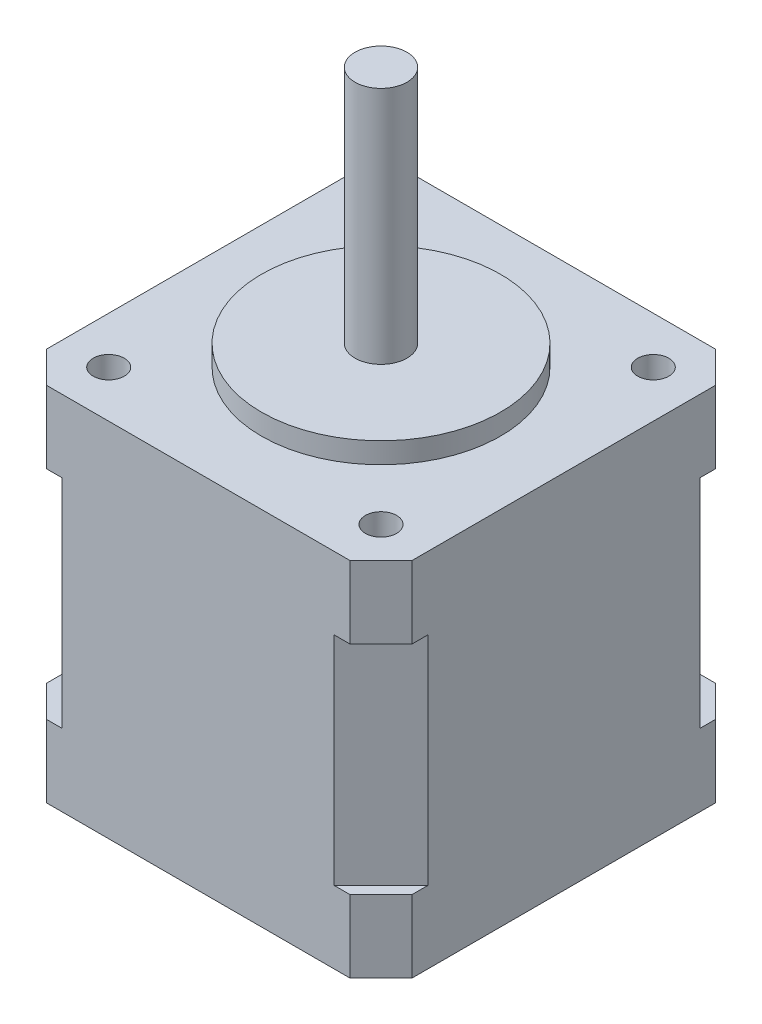
ISO-10303-21;
HEADER;
FILE_DESCRIPTION(('STEP AP214'),'2;1');
FILE_NAME('part.step','',(''),(''),'','','');
FILE_SCHEMA(('AUTOMOTIVE_DESIGN { 1 0 10303 214 1 1 1 1 }'));
ENDSEC;
DATA;
#1=APPLICATION_CONTEXT('core data for automotive mechanical design processes');
#2=APPLICATION_PROTOCOL_DEFINITION('international standard','automotive_design',2000,#1);
#3=PRODUCT_CONTEXT('',#1,'mechanical');
#4=PRODUCT('Part','Part','',(#3));
#5=PRODUCT_RELATED_PRODUCT_CATEGORY('part','',(#4));
#6=PRODUCT_DEFINITION_FORMATION('','',#4);
#7=PRODUCT_DEFINITION_CONTEXT('part definition',#1,'design');
#8=PRODUCT_DEFINITION('design','',#6,#7);
#9=PRODUCT_DEFINITION_SHAPE('','',#8);
#10=(LENGTH_UNIT() NAMED_UNIT(*) SI_UNIT(.MILLI.,.METRE.));
#11=(NAMED_UNIT(*) PLANE_ANGLE_UNIT() SI_UNIT($,.RADIAN.));
#12=(NAMED_UNIT(*) SI_UNIT($,.STERADIAN.) SOLID_ANGLE_UNIT());
#13=UNCERTAINTY_MEASURE_WITH_UNIT(LENGTH_MEASURE(1.E-05),#10,'distance_accuracy_value','');
#14=(GEOMETRIC_REPRESENTATION_CONTEXT(3) GLOBAL_UNCERTAINTY_ASSIGNED_CONTEXT((#13)) GLOBAL_UNIT_ASSIGNED_CONTEXT((#10,
#11,#12)) REPRESENTATION_CONTEXT('',''));
#15=CARTESIAN_POINT('',(0.,0.,0.));
#16=DIRECTION('',(0.,0.,1.));
#17=DIRECTION('',(1.,0.,0.));
#18=AXIS2_PLACEMENT_3D('',#15,#16,#17);
#19=CARTESIAN_POINT('',(0.,0.,0.));
#20=DIRECTION('',(0.,1.,0.));
#21=DIRECTION('',(0.,0.,1.));
#22=AXIS2_PLACEMENT_3D('',#19,#20,#21);
#23=PLANE('',#22);
#24=CARTESIAN_POINT('',(0.,0.,0.));
#25=DIRECTION('',(0.,-1.,0.));
#26=DIRECTION('',(0.,0.,-1.));
#27=AXIS2_PLACEMENT_3D('',#24,#25,#26);
#28=CIRCLE('',#27,2.5);
#29=CARTESIAN_POINT('',(0.,0.,-2.5));
#30=VERTEX_POINT('',#29);
#31=EDGE_CURVE('E293',#30,#30,#28,.T.);
#32=ORIENTED_EDGE('',*,*,#31,.F.);
#33=EDGE_LOOP('',(#32));
#34=FACE_BOUND('',#33,.T.);
#35=DIRECTION('',(-1.,0.,0.));
#36=VECTOR('',#35,1.);
#37=CARTESIAN_POINT('',(-17.6,0.,-17.6));
#38=LINE('',#37,#36);
#39=CARTESIAN_POINT('',(14.6,0.,-17.6));
#40=VERTEX_POINT('',#39);
#41=CARTESIAN_POINT('',(-14.6,0.,-17.6));
#42=VERTEX_POINT('',#41);
#43=EDGE_CURVE('E421',#40,#42,#38,.T.);
#44=ORIENTED_EDGE('',*,*,#43,.F.);
#45=DIRECTION('',(-0.707106781186548,0.,-0.707106781186547));
#46=VECTOR('',#45,1.);
#47=CARTESIAN_POINT('',(17.6,0.,-14.6));
#48=LINE('',#47,#46);
#49=CARTESIAN_POINT('',(17.6,0.,-14.6));
#50=VERTEX_POINT('',#49);
#51=EDGE_CURVE('E297',#50,#40,#48,.T.);
#52=ORIENTED_EDGE('',*,*,#51,.F.);
#53=DIRECTION('',(0.,0.,-1.));
#54=VECTOR('',#53,1.);
#55=CARTESIAN_POINT('',(17.6,0.,-17.6));
#56=LINE('',#55,#54);
#57=CARTESIAN_POINT('',(17.6,0.,14.6));
#58=VERTEX_POINT('',#57);
#59=EDGE_CURVE('E406',#58,#50,#56,.T.);
#60=ORIENTED_EDGE('',*,*,#59,.F.);
#61=DIRECTION('',(-0.707106781186548,0.,0.707106781186547));
#62=VECTOR('',#61,1.);
#63=CARTESIAN_POINT('',(17.6,0.,14.6));
#64=LINE('',#63,#62);
#65=CARTESIAN_POINT('',(14.6,0.,17.6));
#66=VERTEX_POINT('',#65);
#67=EDGE_CURVE('E317',#58,#66,#64,.T.);
#68=ORIENTED_EDGE('',*,*,#67,.T.);
#69=DIRECTION('',(1.,0.,0.));
#70=VECTOR('',#69,1.);
#71=CARTESIAN_POINT('',(-17.6,0.,17.6));
#72=LINE('',#71,#70);
#73=CARTESIAN_POINT('',(-14.6,0.,17.6));
#74=VERTEX_POINT('',#73);
#75=EDGE_CURVE('E42',#74,#66,#72,.T.);
#76=ORIENTED_EDGE('',*,*,#75,.F.);
#77=DIRECTION('',(0.707106781186548,0.,0.707106781186547));
#78=VECTOR('',#77,1.);
#79=CARTESIAN_POINT('',(-17.6,0.,14.6));
#80=LINE('',#79,#78);
#81=CARTESIAN_POINT('',(-17.6,0.,14.6));
#82=VERTEX_POINT('',#81);
#83=EDGE_CURVE('E326',#82,#74,#80,.T.);
#84=ORIENTED_EDGE('',*,*,#83,.F.);
#85=DIRECTION('',(0.,0.,1.));
#86=VECTOR('',#85,1.);
#87=CARTESIAN_POINT('',(-17.6,0.,-17.6));
#88=LINE('',#87,#86);
#89=CARTESIAN_POINT('',(-17.6,0.,-14.6));
#90=VERTEX_POINT('',#89);
#91=EDGE_CURVE('E63',#90,#82,#88,.T.);
#92=ORIENTED_EDGE('',*,*,#91,.F.);
#93=DIRECTION('',(0.707106781186548,0.,-0.707106781186547));
#94=VECTOR('',#93,1.);
#95=CARTESIAN_POINT('',(-17.6,0.,-14.6));
#96=LINE('',#95,#94);
#97=EDGE_CURVE('E307',#90,#42,#96,.T.);
#98=ORIENTED_EDGE('',*,*,#97,.T.);
#99=EDGE_LOOP('',(#44,#52,#60,#68,#76,#84,#92,#98));
#100=FACE_BOUND('',#99,.T.);
#101=ADVANCED_FACE('F38',(#34,#100),#23,.F.);
#102=CARTESIAN_POINT('',(-17.6,34.8,-17.6));
#103=DIRECTION('',(1.,0.,0.));
#104=DIRECTION('',(0.,0.,-1.));
#105=AXIS2_PLACEMENT_3D('',#102,#103,#104);
#106=PLANE('',#105);
#107=DIRECTION('',(0.,-1.,0.));
#108=VECTOR('',#107,1.);
#109=CARTESIAN_POINT('',(-17.6,6.96,14.6));
#110=LINE('',#109,#108);
#111=CARTESIAN_POINT('',(-17.6,6.96,14.6));
#112=VERTEX_POINT('',#111);
#113=EDGE_CURVE('E224',#112,#82,#110,.T.);
#114=ORIENTED_EDGE('',*,*,#113,.F.);
#115=DIRECTION('',(0.,0.,1.));
#116=VECTOR('',#115,1.);
#117=CARTESIAN_POINT('',(-17.6,6.96,17.6));
#118=LINE('',#117,#116);
#119=CARTESIAN_POINT('',(-17.6,6.96,13.1));
#120=VERTEX_POINT('',#119);
#121=EDGE_CURVE('E214',#120,#112,#118,.T.);
#122=ORIENTED_EDGE('',*,*,#121,.F.);
#123=DIRECTION('',(0.,1.,0.));
#124=VECTOR('',#123,1.);
#125=CARTESIAN_POINT('',(-17.6,0.596038969321061,13.1));
#126=LINE('',#125,#124);
#127=CARTESIAN_POINT('',(-17.6,27.84,13.1));
#128=VERTEX_POINT('',#127);
#129=EDGE_CURVE('E204',#120,#128,#126,.T.);
#130=ORIENTED_EDGE('',*,*,#129,.T.);
#131=DIRECTION('',(0.,0.,1.));
#132=VECTOR('',#131,1.);
#133=CARTESIAN_POINT('',(-17.6,27.84,17.6));
#134=LINE('',#133,#132);
#135=CARTESIAN_POINT('',(-17.6,27.84,14.6));
#136=VERTEX_POINT('',#135);
#137=EDGE_CURVE('E221',#128,#136,#134,.T.);
#138=ORIENTED_EDGE('',*,*,#137,.T.);
#139=DIRECTION('',(0.,1.,0.));
#140=VECTOR('',#139,1.);
#141=CARTESIAN_POINT('',(-17.6,27.84,14.6));
#142=LINE('',#141,#140);
#143=CARTESIAN_POINT('',(-17.6,34.8,14.6));
#144=VERTEX_POINT('',#143);
#145=EDGE_CURVE('E351',#136,#144,#142,.T.);
#146=ORIENTED_EDGE('',*,*,#145,.T.);
#147=DIRECTION('',(0.,0.,1.));
#148=VECTOR('',#147,1.);
#149=CARTESIAN_POINT('',(-17.6,34.8,-17.6));
#150=LINE('',#149,#148);
#151=CARTESIAN_POINT('',(-17.6,34.8,-14.6));
#152=VERTEX_POINT('',#151);
#153=EDGE_CURVE('E414',#152,#144,#150,.T.);
#154=ORIENTED_EDGE('',*,*,#153,.F.);
#155=DIRECTION('',(0.,1.,0.));
#156=VECTOR('',#155,1.);
#157=CARTESIAN_POINT('',(-17.6,27.84,-14.6));
#158=LINE('',#157,#156);
#159=CARTESIAN_POINT('',(-17.6,27.84,-14.6));
#160=VERTEX_POINT('',#159);
#161=EDGE_CURVE('E369',#160,#152,#158,.T.);
#162=ORIENTED_EDGE('',*,*,#161,.F.);
#163=DIRECTION('',(0.,0.,1.));
#164=VECTOR('',#163,1.);
#165=CARTESIAN_POINT('',(-17.6,27.84,-17.6));
#166=LINE('',#165,#164);
#167=CARTESIAN_POINT('',(-17.6,27.84,-13.1));
#168=VERTEX_POINT('',#167);
#169=EDGE_CURVE('E281',#160,#168,#166,.T.);
#170=ORIENTED_EDGE('',*,*,#169,.T.);
#171=DIRECTION('',(0.,1.,0.));
#172=VECTOR('',#171,1.);
#173=CARTESIAN_POINT('',(-17.6,0.596038969321075,-13.1));
#174=LINE('',#173,#172);
#175=CARTESIAN_POINT('',(-17.6,6.96,-13.1));
#176=VERTEX_POINT('',#175);
#177=EDGE_CURVE('E287',#176,#168,#174,.T.);
#178=ORIENTED_EDGE('',*,*,#177,.F.);
#179=DIRECTION('',(0.,0.,1.));
#180=VECTOR('',#179,1.);
#181=CARTESIAN_POINT('',(-17.6,6.96,-17.6));
#182=LINE('',#181,#180);
#183=CARTESIAN_POINT('',(-17.6,6.96,-14.6));
#184=VERTEX_POINT('',#183);
#185=EDGE_CURVE('E275',#184,#176,#182,.T.);
#186=ORIENTED_EDGE('',*,*,#185,.F.);
#187=DIRECTION('',(0.,-1.,0.));
#188=VECTOR('',#187,1.);
#189=CARTESIAN_POINT('',(-17.6,6.96,-14.6));
#190=LINE('',#189,#188);
#191=EDGE_CURVE('E315',#184,#90,#190,.T.);
#192=ORIENTED_EDGE('',*,*,#191,.T.);
#193=ORIENTED_EDGE('',*,*,#91,.T.);
#194=EDGE_LOOP('',(#114,#122,#130,#138,#146,#154,#162,#170,#178,#186,#192,#193));
#195=FACE_BOUND('',#194,.T.);
#196=ADVANCED_FACE('F223',(#195),#106,.F.);
#197=CARTESIAN_POINT('',(-17.6,34.8,-17.6));
#198=DIRECTION('',(0.,0.,1.));
#199=DIRECTION('',(1.,0.,0.));
#200=AXIS2_PLACEMENT_3D('',#197,#198,#199);
#201=PLANE('',#200);
#202=DIRECTION('',(0.,1.,0.));
#203=VECTOR('',#202,1.);
#204=CARTESIAN_POINT('',(13.1,0.596038969321075,-17.6));
#205=LINE('',#204,#203);
#206=CARTESIAN_POINT('',(13.1,6.96,-17.6));
#207=VERTEX_POINT('',#206);
#208=CARTESIAN_POINT('',(13.1,27.84,-17.6));
#209=VERTEX_POINT('',#208);
#210=EDGE_CURVE('E262',#207,#209,#205,.T.);
#211=ORIENTED_EDGE('',*,*,#210,.F.);
#212=DIRECTION('',(-1.,0.,0.));
#213=VECTOR('',#212,1.);
#214=CARTESIAN_POINT('',(17.6,6.96,-17.6));
#215=LINE('',#214,#213);
#216=CARTESIAN_POINT('',(14.6,6.96,-17.6));
#217=VERTEX_POINT('',#216);
#218=EDGE_CURVE('E255',#217,#207,#215,.T.);
#219=ORIENTED_EDGE('',*,*,#218,.F.);
#220=DIRECTION('',(0.,-1.,0.));
#221=VECTOR('',#220,1.);
#222=CARTESIAN_POINT('',(14.6,6.96,-17.6));
#223=LINE('',#222,#221);
#224=EDGE_CURVE('E304',#217,#40,#223,.T.);
#225=ORIENTED_EDGE('',*,*,#224,.T.);
#226=ORIENTED_EDGE('',*,*,#43,.T.);
#227=DIRECTION('',(0.,-1.,0.));
#228=VECTOR('',#227,1.);
#229=CARTESIAN_POINT('',(-14.6,6.96,-17.6));
#230=LINE('',#229,#228);
#231=CARTESIAN_POINT('',(-14.6,6.96,-17.6));
#232=VERTEX_POINT('',#231);
#233=EDGE_CURVE('E312',#232,#42,#230,.T.);
#234=ORIENTED_EDGE('',*,*,#233,.F.);
#235=DIRECTION('',(1.,0.,0.));
#236=VECTOR('',#235,1.);
#237=CARTESIAN_POINT('',(-17.6,6.96,-17.6));
#238=LINE('',#237,#236);
#239=CARTESIAN_POINT('',(-13.1,6.96,-17.6));
#240=VERTEX_POINT('',#239);
#241=EDGE_CURVE('E265',#232,#240,#238,.T.);
#242=ORIENTED_EDGE('',*,*,#241,.T.);
#243=DIRECTION('',(0.,1.,0.));
#244=VECTOR('',#243,1.);
#245=CARTESIAN_POINT('',(-13.1,0.596038969321075,-17.6));
#246=LINE('',#245,#244);
#247=CARTESIAN_POINT('',(-13.1,27.84,-17.6));
#248=VERTEX_POINT('',#247);
#249=EDGE_CURVE('E276',#240,#248,#246,.T.);
#250=ORIENTED_EDGE('',*,*,#249,.T.);
#251=DIRECTION('',(1.,0.,0.));
#252=VECTOR('',#251,1.);
#253=CARTESIAN_POINT('',(-17.6,27.84,-17.6));
#254=LINE('',#253,#252);
#255=CARTESIAN_POINT('',(-14.6,27.84,-17.6));
#256=VERTEX_POINT('',#255);
#257=EDGE_CURVE('E273',#256,#248,#254,.T.);
#258=ORIENTED_EDGE('',*,*,#257,.F.);
#259=DIRECTION('',(0.,1.,0.));
#260=VECTOR('',#259,1.);
#261=CARTESIAN_POINT('',(-14.6,27.84,-17.6));
#262=LINE('',#261,#260);
#263=CARTESIAN_POINT('',(-14.6,34.8,-17.6));
#264=VERTEX_POINT('',#263);
#265=EDGE_CURVE('E372',#256,#264,#262,.T.);
#266=ORIENTED_EDGE('',*,*,#265,.T.);
#267=DIRECTION('',(-1.,0.,0.));
#268=VECTOR('',#267,1.);
#269=CARTESIAN_POINT('',(-17.6,34.8,-17.6));
#270=LINE('',#269,#268);
#271=CARTESIAN_POINT('',(14.6,34.8,-17.6));
#272=VERTEX_POINT('',#271);
#273=EDGE_CURVE('E412',#272,#264,#270,.T.);
#274=ORIENTED_EDGE('',*,*,#273,.F.);
#275=DIRECTION('',(0.,1.,0.));
#276=VECTOR('',#275,1.);
#277=CARTESIAN_POINT('',(14.6,27.84,-17.6));
#278=LINE('',#277,#276);
#279=CARTESIAN_POINT('',(14.6,27.84,-17.6));
#280=VERTEX_POINT('',#279);
#281=EDGE_CURVE('E359',#280,#272,#278,.T.);
#282=ORIENTED_EDGE('',*,*,#281,.F.);
#283=DIRECTION('',(-1.,0.,0.));
#284=VECTOR('',#283,1.);
#285=CARTESIAN_POINT('',(17.6,27.84,-17.6));
#286=LINE('',#285,#284);
#287=EDGE_CURVE('E256',#280,#209,#286,.T.);
#288=ORIENTED_EDGE('',*,*,#287,.T.);
#289=EDGE_LOOP('',(#211,#219,#225,#226,#234,#242,#250,#258,#266,#274,#282,#288));
#290=FACE_BOUND('',#289,.T.);
#291=ADVANCED_FACE('F466',(#290),#201,.F.);
#292=CARTESIAN_POINT('',(-17.6,34.8,17.6));
#293=DIRECTION('',(0.,0.,-1.));
#294=DIRECTION('',(-1.,0.,0.));
#295=AXIS2_PLACEMENT_3D('',#292,#293,#294);
#296=PLANE('',#295);
#297=DIRECTION('',(0.,1.,0.));
#298=VECTOR('',#297,1.);
#299=CARTESIAN_POINT('',(-13.1,0.596038969321061,17.6));
#300=LINE('',#299,#298);
#301=CARTESIAN_POINT('',(-13.1,6.96,17.6));
#302=VERTEX_POINT('',#301);
#303=CARTESIAN_POINT('',(-13.1,27.84,17.6));
#304=VERTEX_POINT('',#303);
#305=EDGE_CURVE('E226',#302,#304,#300,.T.);
#306=ORIENTED_EDGE('',*,*,#305,.F.);
#307=DIRECTION('',(1.,0.,0.));
#308=VECTOR('',#307,1.);
#309=CARTESIAN_POINT('',(-17.6,6.96,17.6));
#310=LINE('',#309,#308);
#311=CARTESIAN_POINT('',(-14.6,6.96,17.6));
#312=VERTEX_POINT('',#311);
#313=EDGE_CURVE('E220',#312,#302,#310,.T.);
#314=ORIENTED_EDGE('',*,*,#313,.F.);
#315=DIRECTION('',(0.,-1.,0.));
#316=VECTOR('',#315,1.);
#317=CARTESIAN_POINT('',(-14.6,6.96,17.6));
#318=LINE('',#317,#316);
#319=EDGE_CURVE('E331',#312,#74,#318,.T.);
#320=ORIENTED_EDGE('',*,*,#319,.T.);
#321=ORIENTED_EDGE('',*,*,#75,.T.);
#322=DIRECTION('',(0.,-1.,0.));
#323=VECTOR('',#322,1.);
#324=CARTESIAN_POINT('',(14.6,6.96,17.6));
#325=LINE('',#324,#323);
#326=CARTESIAN_POINT('',(14.6,6.96,17.6));
#327=VERTEX_POINT('',#326);
#328=EDGE_CURVE('E55',#327,#66,#325,.T.);
#329=ORIENTED_EDGE('',*,*,#328,.F.);
#330=DIRECTION('',(1.,0.,0.));
#331=VECTOR('',#330,1.);
#332=CARTESIAN_POINT('',(17.6,6.96,17.6));
#333=LINE('',#332,#331);
#334=CARTESIAN_POINT('',(13.1,6.96,17.6));
#335=VERTEX_POINT('',#334);
#336=EDGE_CURVE('E242',#335,#327,#333,.T.);
#337=ORIENTED_EDGE('',*,*,#336,.F.);
#338=DIRECTION('',(0.,1.,0.));
#339=VECTOR('',#338,1.);
#340=CARTESIAN_POINT('',(13.1,0.596038969321068,17.6));
#341=LINE('',#340,#339);
#342=CARTESIAN_POINT('',(13.1,27.84,17.6));
#343=VERTEX_POINT('',#342);
#344=EDGE_CURVE('E245',#335,#343,#341,.T.);
#345=ORIENTED_EDGE('',*,*,#344,.T.);
#346=DIRECTION('',(1.,0.,0.));
#347=VECTOR('',#346,1.);
#348=CARTESIAN_POINT('',(17.6,27.84,17.6));
#349=LINE('',#348,#347);
#350=CARTESIAN_POINT('',(14.6,27.84,17.6));
#351=VERTEX_POINT('',#350);
#352=EDGE_CURVE('E230',#343,#351,#349,.T.);
#353=ORIENTED_EDGE('',*,*,#352,.T.);
#354=DIRECTION('',(0.,1.,0.));
#355=VECTOR('',#354,1.);
#356=CARTESIAN_POINT('',(14.6,27.84,17.6));
#357=LINE('',#356,#355);
#358=CARTESIAN_POINT('',(14.6,34.8,17.6));
#359=VERTEX_POINT('',#358);
#360=EDGE_CURVE('E340',#351,#359,#357,.T.);
#361=ORIENTED_EDGE('',*,*,#360,.T.);
#362=DIRECTION('',(1.,0.,0.));
#363=VECTOR('',#362,1.);
#364=CARTESIAN_POINT('',(-17.6,34.8,17.6));
#365=LINE('',#364,#363);
#366=CARTESIAN_POINT('',(-14.6,34.8,17.6));
#367=VERTEX_POINT('',#366);
#368=EDGE_CURVE('E409',#367,#359,#365,.T.);
#369=ORIENTED_EDGE('',*,*,#368,.F.);
#370=DIRECTION('',(0.,1.,0.));
#371=VECTOR('',#370,1.);
#372=CARTESIAN_POINT('',(-14.6,27.84,17.6));
#373=LINE('',#372,#371);
#374=CARTESIAN_POINT('',(-14.6,27.84,17.6));
#375=VERTEX_POINT('',#374);
#376=EDGE_CURVE('E348',#375,#367,#373,.T.);
#377=ORIENTED_EDGE('',*,*,#376,.F.);
#378=DIRECTION('',(1.,0.,0.));
#379=VECTOR('',#378,1.);
#380=CARTESIAN_POINT('',(-17.6,27.84,17.6));
#381=LINE('',#380,#379);
#382=EDGE_CURVE('E479',#375,#304,#381,.T.);
#383=ORIENTED_EDGE('',*,*,#382,.T.);
#384=EDGE_LOOP('',(#306,#314,#320,#321,#329,#337,#345,#353,#361,#369,#377,#383));
#385=FACE_BOUND('',#384,.T.);
#386=ADVANCED_FACE('F425',(#385),#296,.F.);
#387=CARTESIAN_POINT('',(17.6,34.8,-17.6));
#388=DIRECTION('',(-1.,0.,0.));
#389=DIRECTION('',(0.,0.,1.));
#390=AXIS2_PLACEMENT_3D('',#387,#388,#389);
#391=PLANE('',#390);
#392=DIRECTION('',(0.,1.,0.));
#393=VECTOR('',#392,1.);
#394=CARTESIAN_POINT('',(17.6,0.596038969321068,13.1));
#395=LINE('',#394,#393);
#396=CARTESIAN_POINT('',(17.6,6.96,13.1));
#397=VERTEX_POINT('',#396);
#398=CARTESIAN_POINT('',(17.6,27.84,13.1));
#399=VERTEX_POINT('',#398);
#400=EDGE_CURVE('E241',#397,#399,#395,.T.);
#401=ORIENTED_EDGE('',*,*,#400,.F.);
#402=DIRECTION('',(0.,0.,-1.));
#403=VECTOR('',#402,1.);
#404=CARTESIAN_POINT('',(17.6,6.96,17.6));
#405=LINE('',#404,#403);
#406=CARTESIAN_POINT('',(17.6,6.96,14.6));
#407=VERTEX_POINT('',#406);
#408=EDGE_CURVE('E234',#407,#397,#405,.T.);
#409=ORIENTED_EDGE('',*,*,#408,.F.);
#410=DIRECTION('',(0.,-1.,0.));
#411=VECTOR('',#410,1.);
#412=CARTESIAN_POINT('',(17.6,6.96,14.6));
#413=LINE('',#412,#411);
#414=EDGE_CURVE('E323',#407,#58,#413,.T.);
#415=ORIENTED_EDGE('',*,*,#414,.T.);
#416=ORIENTED_EDGE('',*,*,#59,.T.);
#417=DIRECTION('',(0.,-1.,0.));
#418=VECTOR('',#417,1.);
#419=CARTESIAN_POINT('',(17.6,6.96,-14.6));
#420=LINE('',#419,#418);
#421=CARTESIAN_POINT('',(17.6,6.96,-14.6));
#422=VERTEX_POINT('',#421);
#423=EDGE_CURVE('E302',#422,#50,#420,.T.);
#424=ORIENTED_EDGE('',*,*,#423,.F.);
#425=DIRECTION('',(0.,0.,-1.));
#426=VECTOR('',#425,1.);
#427=CARTESIAN_POINT('',(17.6,6.96,-17.6));
#428=LINE('',#427,#426);
#429=CARTESIAN_POINT('',(17.6,6.96,-13.1));
#430=VERTEX_POINT('',#429);
#431=EDGE_CURVE('E263',#430,#422,#428,.T.);
#432=ORIENTED_EDGE('',*,*,#431,.F.);
#433=DIRECTION('',(0.,1.,0.));
#434=VECTOR('',#433,1.);
#435=CARTESIAN_POINT('',(17.6,0.596038969321075,-13.1));
#436=LINE('',#435,#434);
#437=CARTESIAN_POINT('',(17.6,27.84,-13.1));
#438=VERTEX_POINT('',#437);
#439=EDGE_CURVE('E266',#430,#438,#436,.T.);
#440=ORIENTED_EDGE('',*,*,#439,.T.);
#441=DIRECTION('',(0.,0.,-1.));
#442=VECTOR('',#441,1.);
#443=CARTESIAN_POINT('',(17.6,27.84,-17.6));
#444=LINE('',#443,#442);
#445=CARTESIAN_POINT('',(17.6,27.84,-14.6));
#446=VERTEX_POINT('',#445);
#447=EDGE_CURVE('E244',#438,#446,#444,.T.);
#448=ORIENTED_EDGE('',*,*,#447,.T.);
#449=DIRECTION('',(0.,1.,0.));
#450=VECTOR('',#449,1.);
#451=CARTESIAN_POINT('',(17.6,27.84,-14.6));
#452=LINE('',#451,#450);
#453=CARTESIAN_POINT('',(17.6,34.8,-14.6));
#454=VERTEX_POINT('',#453);
#455=EDGE_CURVE('E362',#446,#454,#452,.T.);
#456=ORIENTED_EDGE('',*,*,#455,.T.);
#457=DIRECTION('',(0.,0.,-1.));
#458=VECTOR('',#457,1.);
#459=CARTESIAN_POINT('',(17.6,34.8,-17.6));
#460=LINE('',#459,#458);
#461=CARTESIAN_POINT('',(17.6,34.8,14.6));
#462=VERTEX_POINT('',#461);
#463=EDGE_CURVE('E410',#462,#454,#460,.T.);
#464=ORIENTED_EDGE('',*,*,#463,.F.);
#465=DIRECTION('',(0.,1.,0.));
#466=VECTOR('',#465,1.);
#467=CARTESIAN_POINT('',(17.6,27.84,14.6));
#468=LINE('',#467,#466);
#469=CARTESIAN_POINT('',(17.6,27.84,14.6));
#470=VERTEX_POINT('',#469);
#471=EDGE_CURVE('E338',#470,#462,#468,.T.);
#472=ORIENTED_EDGE('',*,*,#471,.F.);
#473=DIRECTION('',(0.,0.,-1.));
#474=VECTOR('',#473,1.);
#475=CARTESIAN_POINT('',(17.6,27.84,17.6));
#476=LINE('',#475,#474);
#477=EDGE_CURVE('E235',#470,#399,#476,.T.);
#478=ORIENTED_EDGE('',*,*,#477,.T.);
#479=EDGE_LOOP('',(#401,#409,#415,#416,#424,#432,#440,#448,#456,#464,#472,#478));
#480=FACE_BOUND('',#479,.T.);
#481=ADVANCED_FACE('F40',(#480),#391,.F.);
#482=CARTESIAN_POINT('',(0.,34.8,0.));
#483=DIRECTION('',(0.,1.,0.));
#484=DIRECTION('',(0.,0.,1.));
#485=AXIS2_PLACEMENT_3D('',#482,#483,#484);
#486=PLANE('',#485);
#487=DIRECTION('',(-0.707106781186548,0.,0.707106781186548));
#488=VECTOR('',#487,1.);
#489=CARTESIAN_POINT('',(17.6,34.8,14.6));
#490=LINE('',#489,#488);
#491=EDGE_CURVE('E334',#462,#359,#490,.T.);
#492=ORIENTED_EDGE('',*,*,#491,.F.);
#493=ORIENTED_EDGE('',*,*,#463,.T.);
#494=DIRECTION('',(-0.707106781186548,0.,-0.707106781186548));
#495=VECTOR('',#494,1.);
#496=CARTESIAN_POINT('',(17.6,34.8,-14.6));
#497=LINE('',#496,#495);
#498=EDGE_CURVE('E354',#454,#272,#497,.T.);
#499=ORIENTED_EDGE('',*,*,#498,.T.);
#500=ORIENTED_EDGE('',*,*,#273,.T.);
#501=DIRECTION('',(0.707106781186548,0.,-0.707106781186548));
#502=VECTOR('',#501,1.);
#503=CARTESIAN_POINT('',(-17.6,34.8,-14.6));
#504=LINE('',#503,#502);
#505=EDGE_CURVE('E365',#152,#264,#504,.T.);
#506=ORIENTED_EDGE('',*,*,#505,.F.);
#507=ORIENTED_EDGE('',*,*,#153,.T.);
#508=DIRECTION('',(0.707106781186548,0.,0.707106781186548));
#509=VECTOR('',#508,1.);
#510=CARTESIAN_POINT('',(-17.6,34.8,14.6));
#511=LINE('',#510,#509);
#512=EDGE_CURVE('E343',#144,#367,#511,.T.);
#513=ORIENTED_EDGE('',*,*,#512,.T.);
#514=ORIENTED_EDGE('',*,*,#368,.T.);
#515=EDGE_LOOP('',(#492,#493,#499,#500,#506,#507,#513,#514));
#516=FACE_BOUND('',#515,.T.);
#517=CARTESIAN_POINT('',(13.1,34.8,13.1));
#518=DIRECTION('',(0.,1.,0.));
#519=DIRECTION('',(0.,0.,-1.));
#520=AXIS2_PLACEMENT_3D('',#517,#518,#519);
#521=CIRCLE('',#520,1.5);
#522=CARTESIAN_POINT('',(13.1,34.8,11.6));
#523=VERTEX_POINT('',#522);
#524=EDGE_CURVE('E375',#523,#523,#521,.T.);
#525=ORIENTED_EDGE('',*,*,#524,.F.);
#526=EDGE_LOOP('',(#525));
#527=FACE_BOUND('',#526,.T.);
#528=CARTESIAN_POINT('',(-13.1,34.8,13.1));
#529=DIRECTION('',(0.,-1.,0.));
#530=DIRECTION('',(0.,0.,-1.));
#531=AXIS2_PLACEMENT_3D('',#528,#529,#530);
#532=CIRCLE('',#531,1.5);
#533=CARTESIAN_POINT('',(-13.1,34.8,11.6));
#534=VERTEX_POINT('',#533);
#535=EDGE_CURVE('E380',#534,#534,#532,.T.);
#536=ORIENTED_EDGE('',*,*,#535,.T.);
#537=EDGE_LOOP('',(#536));
#538=FACE_BOUND('',#537,.T.);
#539=CARTESIAN_POINT('',(13.1,34.8,-13.1));
#540=DIRECTION('',(0.,-1.,0.));
#541=DIRECTION('',(0.,0.,1.));
#542=AXIS2_PLACEMENT_3D('',#539,#540,#541);
#543=CIRCLE('',#542,1.5);
#544=CARTESIAN_POINT('',(13.1,34.8,-11.6));
#545=VERTEX_POINT('',#544);
#546=EDGE_CURVE('E386',#545,#545,#543,.T.);
#547=ORIENTED_EDGE('',*,*,#546,.T.);
#548=EDGE_LOOP('',(#547));
#549=FACE_BOUND('',#548,.T.);
#550=CARTESIAN_POINT('',(-13.1,34.8,-13.1));
#551=DIRECTION('',(0.,1.,0.));
#552=DIRECTION('',(0.,0.,1.));
#553=AXIS2_PLACEMENT_3D('',#550,#551,#552);
#554=CIRCLE('',#553,1.5);
#555=CARTESIAN_POINT('',(-13.1,34.8,-11.6));
#556=VERTEX_POINT('',#555);
#557=EDGE_CURVE('E392',#556,#556,#554,.T.);
#558=ORIENTED_EDGE('',*,*,#557,.F.);
#559=EDGE_LOOP('',(#558));
#560=FACE_BOUND('',#559,.T.);
#561=CARTESIAN_POINT('',(0.,34.8,0.));
#562=DIRECTION('',(0.,1.,0.));
#563=DIRECTION('',(0.,0.,1.));
#564=AXIS2_PLACEMENT_3D('',#561,#562,#563);
#565=CIRCLE('',#564,11.5);
#566=CARTESIAN_POINT('',(0.,34.8,11.5));
#567=VERTEX_POINT('',#566);
#568=EDGE_CURVE('E47',#567,#567,#565,.T.);
#569=ORIENTED_EDGE('',*,*,#568,.F.);
#570=EDGE_LOOP('',(#569));
#571=FACE_BOUND('',#570,.T.);
#572=ADVANCED_FACE('F455',(#516,#527,#538,#549,#560,#571),#486,.T.);
#573=CARTESIAN_POINT('',(0.,36.8,0.));
#574=DIRECTION('',(0.,-1.,0.));
#575=DIRECTION('',(0.,0.,-1.));
#576=AXIS2_PLACEMENT_3D('',#573,#574,#575);
#577=CYLINDRICAL_SURFACE('',#576,11.5);
#578=CARTESIAN_POINT('',(0.,36.8,0.));
#579=DIRECTION('',(0.,1.,0.));
#580=DIRECTION('',(0.,0.,1.));
#581=AXIS2_PLACEMENT_3D('',#578,#579,#580);
#582=CIRCLE('',#581,11.5);
#583=CARTESIAN_POINT('',(0.,36.8,11.5));
#584=VERTEX_POINT('',#583);
#585=EDGE_CURVE('E402',#584,#584,#582,.T.);
#586=ORIENTED_EDGE('',*,*,#585,.F.);
#587=EDGE_LOOP('',(#586));
#588=FACE_BOUND('',#587,.T.);
#589=ORIENTED_EDGE('',*,*,#568,.T.);
#590=EDGE_LOOP('',(#589));
#591=FACE_BOUND('',#590,.T.);
#592=ADVANCED_FACE('F530',(#588,#591),#577,.T.);
#593=CARTESIAN_POINT('',(0.,36.8,0.));
#594=DIRECTION('',(0.,1.,0.));
#595=DIRECTION('',(0.,0.,1.));
#596=AXIS2_PLACEMENT_3D('',#593,#594,#595);
#597=PLANE('',#596);
#598=CARTESIAN_POINT('',(0.,36.8,0.));
#599=DIRECTION('',(0.,1.,0.));
#600=DIRECTION('',(0.,0.,1.));
#601=AXIS2_PLACEMENT_3D('',#598,#599,#600);
#602=CIRCLE('',#601,2.5);
#603=CARTESIAN_POINT('',(0.,36.8,2.5));
#604=VERTEX_POINT('',#603);
#605=EDGE_CURVE('E11',#604,#604,#602,.T.);
#606=ORIENTED_EDGE('',*,*,#605,.F.);
#607=EDGE_LOOP('',(#606));
#608=FACE_BOUND('',#607,.T.);
#609=ORIENTED_EDGE('',*,*,#585,.T.);
#610=EDGE_LOOP('',(#609));
#611=FACE_BOUND('',#610,.T.);
#612=ADVANCED_FACE('F537',(#608,#611),#597,.T.);
#613=CARTESIAN_POINT('',(0.,59.8,0.));
#614=DIRECTION('',(0.,-1.,0.));
#615=DIRECTION('',(0.,0.,-1.));
#616=AXIS2_PLACEMENT_3D('',#613,#614,#615);
#617=CYLINDRICAL_SURFACE('',#616,2.5);
#618=CARTESIAN_POINT('',(0.,59.8,0.));
#619=DIRECTION('',(0.,1.,0.));
#620=DIRECTION('',(0.,0.,1.));
#621=AXIS2_PLACEMENT_3D('',#618,#619,#620);
#622=CIRCLE('',#621,2.5);
#623=CARTESIAN_POINT('',(0.,59.8,2.5));
#624=VERTEX_POINT('',#623);
#625=EDGE_CURVE('E398',#624,#624,#622,.T.);
#626=ORIENTED_EDGE('',*,*,#625,.F.);
#627=EDGE_LOOP('',(#626));
#628=FACE_BOUND('',#627,.T.);
#629=ORIENTED_EDGE('',*,*,#605,.T.);
#630=EDGE_LOOP('',(#629));
#631=FACE_BOUND('',#630,.T.);
#632=ADVANCED_FACE('F545',(#628,#631),#617,.T.);
#633=CARTESIAN_POINT('',(0.,59.8,0.));
#634=DIRECTION('',(0.,1.,0.));
#635=DIRECTION('',(0.,0.,1.));
#636=AXIS2_PLACEMENT_3D('',#633,#634,#635);
#637=PLANE('',#636);
#638=ORIENTED_EDGE('',*,*,#625,.T.);
#639=EDGE_LOOP('',(#638));
#640=FACE_BOUND('',#639,.T.);
#641=ADVANCED_FACE('F553',(#640),#637,.T.);
#642=CARTESIAN_POINT('',(-13.1,26.8,-13.1));
#643=DIRECTION('',(0.,1.,0.));
#644=DIRECTION('',(0.,0.,1.));
#645=AXIS2_PLACEMENT_3D('',#642,#643,#644);
#646=CYLINDRICAL_SURFACE('',#645,1.5);
#647=CARTESIAN_POINT('',(-13.1,26.8,-13.1));
#648=DIRECTION('',(0.,1.,0.));
#649=DIRECTION('',(0.,0.,1.));
#650=AXIS2_PLACEMENT_3D('',#647,#648,#649);
#651=CIRCLE('',#650,1.5);
#652=CARTESIAN_POINT('',(-13.1,26.8,-11.6));
#653=VERTEX_POINT('',#652);
#654=EDGE_CURVE('E395',#653,#653,#651,.T.);
#655=ORIENTED_EDGE('',*,*,#654,.F.);
#656=EDGE_LOOP('',(#655));
#657=FACE_BOUND('',#656,.T.);
#658=ORIENTED_EDGE('',*,*,#557,.T.);
#659=EDGE_LOOP('',(#658));
#660=FACE_BOUND('',#659,.T.);
#661=ADVANCED_FACE('F561',(#657,#660),#646,.F.);
#662=CARTESIAN_POINT('',(-13.1,26.8,-13.1));
#663=DIRECTION('',(0.,1.,0.));
#664=DIRECTION('',(0.,0.,1.));
#665=AXIS2_PLACEMENT_3D('',#662,#663,#664);
#666=PLANE('',#665);
#667=ORIENTED_EDGE('',*,*,#654,.T.);
#668=EDGE_LOOP('',(#667));
#669=FACE_BOUND('',#668,.T.);
#670=ADVANCED_FACE('F569',(#669),#666,.T.);
#671=CARTESIAN_POINT('',(13.1,26.8,-13.1));
#672=DIRECTION('',(0.,1.,0.));
#673=DIRECTION('',(0.,0.,1.));
#674=AXIS2_PLACEMENT_3D('',#671,#672,#673);
#675=CYLINDRICAL_SURFACE('',#674,1.5);
#676=CARTESIAN_POINT('',(13.1,26.8,-13.1));
#677=DIRECTION('',(0.,-1.,0.));
#678=DIRECTION('',(0.,0.,1.));
#679=AXIS2_PLACEMENT_3D('',#676,#677,#678);
#680=CIRCLE('',#679,1.5);
#681=CARTESIAN_POINT('',(13.1,26.8,-11.6));
#682=VERTEX_POINT('',#681);
#683=EDGE_CURVE('E389',#682,#682,#680,.T.);
#684=ORIENTED_EDGE('',*,*,#683,.T.);
#685=EDGE_LOOP('',(#684));
#686=FACE_BOUND('',#685,.T.);
#687=ORIENTED_EDGE('',*,*,#546,.F.);
#688=EDGE_LOOP('',(#687));
#689=FACE_BOUND('',#688,.T.);
#690=ADVANCED_FACE('F579',(#686,#689),#675,.F.);
#691=CARTESIAN_POINT('',(13.1,26.8,-13.1));
#692=DIRECTION('',(0.,1.,0.));
#693=DIRECTION('',(0.,0.,1.));
#694=AXIS2_PLACEMENT_3D('',#691,#692,#693);
#695=PLANE('',#694);
#696=ORIENTED_EDGE('',*,*,#683,.F.);
#697=EDGE_LOOP('',(#696));
#698=FACE_BOUND('',#697,.T.);
#699=ADVANCED_FACE('F587',(#698),#695,.T.);
#700=CARTESIAN_POINT('',(-13.1,26.8,13.1));
#701=DIRECTION('',(0.,1.,0.));
#702=DIRECTION('',(0.,0.,1.));
#703=AXIS2_PLACEMENT_3D('',#700,#701,#702);
#704=CYLINDRICAL_SURFACE('',#703,1.5);
#705=CARTESIAN_POINT('',(-13.1,26.8,13.1));
#706=DIRECTION('',(0.,-1.,0.));
#707=DIRECTION('',(0.,0.,-1.));
#708=AXIS2_PLACEMENT_3D('',#705,#706,#707);
#709=CIRCLE('',#708,1.5);
#710=CARTESIAN_POINT('',(-13.1,26.8,11.6));
#711=VERTEX_POINT('',#710);
#712=EDGE_CURVE('E383',#711,#711,#709,.T.);
#713=ORIENTED_EDGE('',*,*,#712,.T.);
#714=EDGE_LOOP('',(#713));
#715=FACE_BOUND('',#714,.T.);
#716=ORIENTED_EDGE('',*,*,#535,.F.);
#717=EDGE_LOOP('',(#716));
#718=FACE_BOUND('',#717,.T.);
#719=ADVANCED_FACE('F594',(#715,#718),#704,.F.);
#720=CARTESIAN_POINT('',(-13.1,26.8,13.1));
#721=DIRECTION('',(0.,1.,0.));
#722=DIRECTION('',(0.,0.,-1.));
#723=AXIS2_PLACEMENT_3D('',#720,#721,#722);
#724=PLANE('',#723);
#725=ORIENTED_EDGE('',*,*,#712,.F.);
#726=EDGE_LOOP('',(#725));
#727=FACE_BOUND('',#726,.T.);
#728=ADVANCED_FACE('F602',(#727),#724,.T.);
#729=CARTESIAN_POINT('',(13.1,26.8,13.1));
#730=DIRECTION('',(0.,1.,0.));
#731=DIRECTION('',(0.,0.,1.));
#732=AXIS2_PLACEMENT_3D('',#729,#730,#731);
#733=CYLINDRICAL_SURFACE('',#732,1.5);
#734=CARTESIAN_POINT('',(13.1,26.8,13.1));
#735=DIRECTION('',(0.,1.,0.));
#736=DIRECTION('',(0.,0.,-1.));
#737=AXIS2_PLACEMENT_3D('',#734,#735,#736);
#738=CIRCLE('',#737,1.5);
#739=CARTESIAN_POINT('',(13.1,26.8,11.6));
#740=VERTEX_POINT('',#739);
#741=EDGE_CURVE('E377',#740,#740,#738,.T.);
#742=ORIENTED_EDGE('',*,*,#741,.F.);
#743=EDGE_LOOP('',(#742));
#744=FACE_BOUND('',#743,.T.);
#745=ORIENTED_EDGE('',*,*,#524,.T.);
#746=EDGE_LOOP('',(#745));
#747=FACE_BOUND('',#746,.T.);
#748=ADVANCED_FACE('F610',(#744,#747),#733,.F.);
#749=CARTESIAN_POINT('',(13.1,26.8,13.1));
#750=DIRECTION('',(0.,1.,0.));
#751=DIRECTION('',(0.,0.,-1.));
#752=AXIS2_PLACEMENT_3D('',#749,#750,#751);
#753=PLANE('',#752);
#754=ORIENTED_EDGE('',*,*,#741,.T.);
#755=EDGE_LOOP('',(#754));
#756=FACE_BOUND('',#755,.T.);
#757=ADVANCED_FACE('F618',(#756),#753,.T.);
#758=CARTESIAN_POINT('',(-17.6,27.84,-14.6));
#759=DIRECTION('',(0.707106781186547,0.,0.707106781186547));
#760=DIRECTION('',(0.707106781186548,0.,-0.707106781186548));
#761=AXIS2_PLACEMENT_3D('',#758,#759,#760);
#762=PLANE('',#761);
#763=ORIENTED_EDGE('',*,*,#505,.T.);
#764=ORIENTED_EDGE('',*,*,#265,.F.);
#765=DIRECTION('',(0.707106781186548,0.,-0.707106781186548));
#766=VECTOR('',#765,1.);
#767=CARTESIAN_POINT('',(-17.6,27.84,-14.6));
#768=LINE('',#767,#766);
#769=EDGE_CURVE('E367',#160,#256,#768,.T.);
#770=ORIENTED_EDGE('',*,*,#769,.F.);
#771=ORIENTED_EDGE('',*,*,#161,.T.);
#772=EDGE_LOOP('',(#763,#764,#770,#771));
#773=FACE_BOUND('',#772,.T.);
#774=ADVANCED_FACE('F471',(#773),#762,.F.);
#775=CARTESIAN_POINT('',(17.6,27.84,-14.6));
#776=DIRECTION('',(0.707106781186547,0.,-0.707106781186547));
#777=DIRECTION('',(-0.707106781186548,0.,-0.707106781186548));
#778=AXIS2_PLACEMENT_3D('',#775,#776,#777);
#779=PLANE('',#778);
#780=ORIENTED_EDGE('',*,*,#498,.F.);
#781=ORIENTED_EDGE('',*,*,#455,.F.);
#782=DIRECTION('',(-0.707106781186548,0.,-0.707106781186548));
#783=VECTOR('',#782,1.);
#784=CARTESIAN_POINT('',(17.6,27.84,-14.6));
#785=LINE('',#784,#783);
#786=EDGE_CURVE('E356',#446,#280,#785,.T.);
#787=ORIENTED_EDGE('',*,*,#786,.T.);
#788=ORIENTED_EDGE('',*,*,#281,.T.);
#789=EDGE_LOOP('',(#780,#781,#787,#788));
#790=FACE_BOUND('',#789,.T.);
#791=ADVANCED_FACE('F460',(#790),#779,.T.);
#792=CARTESIAN_POINT('',(-17.6,27.84,14.6));
#793=DIRECTION('',(-0.707106781186547,0.,0.707106781186547));
#794=DIRECTION('',(0.707106781186548,0.,0.707106781186548));
#795=AXIS2_PLACEMENT_3D('',#792,#793,#794);
#796=PLANE('',#795);
#797=ORIENTED_EDGE('',*,*,#512,.F.);
#798=ORIENTED_EDGE('',*,*,#145,.F.);
#799=DIRECTION('',(0.707106781186548,0.,0.707106781186548));
#800=VECTOR('',#799,1.);
#801=CARTESIAN_POINT('',(-17.6,27.84,14.6));
#802=LINE('',#801,#800);
#803=EDGE_CURVE('E345',#136,#375,#802,.T.);
#804=ORIENTED_EDGE('',*,*,#803,.T.);
#805=ORIENTED_EDGE('',*,*,#376,.T.);
#806=EDGE_LOOP('',(#797,#798,#804,#805));
#807=FACE_BOUND('',#806,.T.);
#808=ADVANCED_FACE('F476',(#807),#796,.T.);
#809=CARTESIAN_POINT('',(17.6,27.84,14.6));
#810=DIRECTION('',(-0.707106781186547,0.,-0.707106781186547));
#811=DIRECTION('',(-0.707106781186548,0.,0.707106781186548));
#812=AXIS2_PLACEMENT_3D('',#809,#810,#811);
#813=PLANE('',#812);
#814=ORIENTED_EDGE('',*,*,#491,.T.);
#815=ORIENTED_EDGE('',*,*,#360,.F.);
#816=DIRECTION('',(-0.707106781186548,0.,0.707106781186548));
#817=VECTOR('',#816,1.);
#818=CARTESIAN_POINT('',(17.6,27.84,14.6));
#819=LINE('',#818,#817);
#820=EDGE_CURVE('E336',#470,#351,#819,.T.);
#821=ORIENTED_EDGE('',*,*,#820,.F.);
#822=ORIENTED_EDGE('',*,*,#471,.T.);
#823=EDGE_LOOP('',(#814,#815,#821,#822));
#824=FACE_BOUND('',#823,.T.);
#825=ADVANCED_FACE('F450',(#824),#813,.F.);
#826=CARTESIAN_POINT('',(-17.6,6.96,14.6));
#827=DIRECTION('',(0.707106781186547,0.,-0.707106781186548));
#828=DIRECTION('',(-0.707106781186548,0.,-0.707106781186547));
#829=AXIS2_PLACEMENT_3D('',#826,#827,#828);
#830=PLANE('',#829);
#831=ORIENTED_EDGE('',*,*,#83,.T.);
#832=ORIENTED_EDGE('',*,*,#319,.F.);
#833=DIRECTION('',(0.707106781186548,0.,0.707106781186547));
#834=VECTOR('',#833,1.);
#835=CARTESIAN_POINT('',(-17.6,6.96,14.6));
#836=LINE('',#835,#834);
#837=EDGE_CURVE('E328',#112,#312,#836,.T.);
#838=ORIENTED_EDGE('',*,*,#837,.F.);
#839=ORIENTED_EDGE('',*,*,#113,.T.);
#840=EDGE_LOOP('',(#831,#832,#838,#839));
#841=FACE_BOUND('',#840,.T.);
#842=ADVANCED_FACE('F649',(#841),#830,.F.);
#843=CARTESIAN_POINT('',(17.6,6.96,14.6));
#844=DIRECTION('',(0.707106781186547,0.,0.707106781186548));
#845=DIRECTION('',(0.707106781186548,0.,-0.707106781186547));
#846=AXIS2_PLACEMENT_3D('',#843,#844,#845);
#847=PLANE('',#846);
#848=ORIENTED_EDGE('',*,*,#67,.F.);
#849=ORIENTED_EDGE('',*,*,#414,.F.);
#850=DIRECTION('',(-0.707106781186548,0.,0.707106781186547));
#851=VECTOR('',#850,1.);
#852=CARTESIAN_POINT('',(17.6,6.96,14.6));
#853=LINE('',#852,#851);
#854=EDGE_CURVE('E320',#407,#327,#853,.T.);
#855=ORIENTED_EDGE('',*,*,#854,.T.);
#856=ORIENTED_EDGE('',*,*,#328,.T.);
#857=EDGE_LOOP('',(#848,#849,#855,#856));
#858=FACE_BOUND('',#857,.T.);
#859=ADVANCED_FACE('F434',(#858),#847,.T.);
#860=CARTESIAN_POINT('',(-17.6,6.96,-14.6));
#861=DIRECTION('',(-0.707106781186547,0.,-0.707106781186548));
#862=DIRECTION('',(-0.707106781186548,0.,0.707106781186547));
#863=AXIS2_PLACEMENT_3D('',#860,#861,#862);
#864=PLANE('',#863);
#865=ORIENTED_EDGE('',*,*,#97,.F.);
#866=ORIENTED_EDGE('',*,*,#191,.F.);
#867=DIRECTION('',(0.707106781186548,0.,-0.707106781186547));
#868=VECTOR('',#867,1.);
#869=CARTESIAN_POINT('',(-17.6,6.96,-14.6));
#870=LINE('',#869,#868);
#871=EDGE_CURVE('E309',#184,#232,#870,.T.);
#872=ORIENTED_EDGE('',*,*,#871,.T.);
#873=ORIENTED_EDGE('',*,*,#233,.T.);
#874=EDGE_LOOP('',(#865,#866,#872,#873));
#875=FACE_BOUND('',#874,.T.);
#876=ADVANCED_FACE('F662',(#875),#864,.T.);
#877=CARTESIAN_POINT('',(17.6,6.96,-14.6));
#878=DIRECTION('',(-0.707106781186547,0.,0.707106781186548));
#879=DIRECTION('',(0.707106781186548,0.,0.707106781186547));
#880=AXIS2_PLACEMENT_3D('',#877,#878,#879);
#881=PLANE('',#880);
#882=ORIENTED_EDGE('',*,*,#51,.T.);
#883=ORIENTED_EDGE('',*,*,#224,.F.);
#884=DIRECTION('',(-0.707106781186548,0.,-0.707106781186547));
#885=VECTOR('',#884,1.);
#886=CARTESIAN_POINT('',(17.6,6.96,-14.6));
#887=LINE('',#886,#885);
#888=EDGE_CURVE('E300',#422,#217,#887,.T.);
#889=ORIENTED_EDGE('',*,*,#888,.F.);
#890=ORIENTED_EDGE('',*,*,#423,.T.);
#891=EDGE_LOOP('',(#882,#883,#889,#890));
#892=FACE_BOUND('',#891,.T.);
#893=ADVANCED_FACE('F668',(#892),#881,.F.);
#894=CARTESIAN_POINT('',(0.,5.,0.));
#895=DIRECTION('',(0.,-1.,0.));
#896=DIRECTION('',(0.,0.,-1.));
#897=AXIS2_PLACEMENT_3D('',#894,#895,#896);
#898=CYLINDRICAL_SURFACE('',#897,2.5);
#899=CARTESIAN_POINT('',(0.,5.,0.));
#900=DIRECTION('',(0.,-1.,0.));
#901=DIRECTION('',(0.,0.,-1.));
#902=AXIS2_PLACEMENT_3D('',#899,#900,#901);
#903=CIRCLE('',#902,2.5);
#904=CARTESIAN_POINT('',(0.,5.,-2.5));
#905=VERTEX_POINT('',#904);
#906=EDGE_CURVE('E294',#905,#905,#903,.T.);
#907=ORIENTED_EDGE('',*,*,#906,.F.);
#908=EDGE_LOOP('',(#907));
#909=FACE_BOUND('',#908,.T.);
#910=ORIENTED_EDGE('',*,*,#31,.T.);
#911=EDGE_LOOP('',(#910));
#912=FACE_BOUND('',#911,.T.);
#913=ADVANCED_FACE('F675',(#909,#912),#898,.F.);
#914=CARTESIAN_POINT('',(0.,5.,0.));
#915=DIRECTION('',(0.,-1.,0.));
#916=DIRECTION('',(0.,0.,-1.));
#917=AXIS2_PLACEMENT_3D('',#914,#915,#916);
#918=PLANE('',#917);
#919=ORIENTED_EDGE('',*,*,#906,.T.);
#920=EDGE_LOOP('',(#919));
#921=FACE_BOUND('',#920,.T.);
#922=ADVANCED_FACE('F682',(#921),#918,.T.);
#923=CARTESIAN_POINT('',(0.,27.84,0.));
#924=DIRECTION('',(0.,1.,0.));
#925=DIRECTION('',(0.,0.,1.));
#926=AXIS2_PLACEMENT_3D('',#923,#924,#925);
#927=PLANE('',#926);
#928=ORIENTED_EDGE('',*,*,#257,.T.);
#929=DIRECTION('',(0.707106781186547,0.,-0.707106781186547));
#930=VECTOR('',#929,1.);
#931=CARTESIAN_POINT('',(-17.6,27.84,-13.1));
#932=LINE('',#931,#930);
#933=EDGE_CURVE('E277',#168,#248,#932,.T.);
#934=ORIENTED_EDGE('',*,*,#933,.F.);
#935=ORIENTED_EDGE('',*,*,#169,.F.);
#936=ORIENTED_EDGE('',*,*,#769,.T.);
#937=EDGE_LOOP('',(#928,#934,#935,#936));
#938=FACE_BOUND('',#937,.T.);
#939=ADVANCED_FACE('F690',(#938),#927,.F.);
#940=CARTESIAN_POINT('',(0.,6.96,0.));
#941=DIRECTION('',(0.,-1.,0.));
#942=DIRECTION('',(0.,0.,1.));
#943=AXIS2_PLACEMENT_3D('',#940,#941,#942);
#944=PLANE('',#943);
#945=ORIENTED_EDGE('',*,*,#871,.F.);
#946=ORIENTED_EDGE('',*,*,#185,.T.);
#947=DIRECTION('',(0.707106781186548,0.,-0.707106781186548));
#948=VECTOR('',#947,1.);
#949=CARTESIAN_POINT('',(-17.6,6.96,-13.1));
#950=LINE('',#949,#948);
#951=EDGE_CURVE('E280',#176,#240,#950,.T.);
#952=ORIENTED_EDGE('',*,*,#951,.T.);
#953=ORIENTED_EDGE('',*,*,#241,.F.);
#954=EDGE_LOOP('',(#945,#946,#952,#953));
#955=FACE_BOUND('',#954,.T.);
#956=ADVANCED_FACE('F698',(#955),#944,.F.);
#957=CARTESIAN_POINT('',(-17.6,0.596038969321075,-13.1));
#958=DIRECTION('',(0.707106781186547,0.,0.707106781186547));
#959=DIRECTION('',(0.707106781186548,0.,-0.707106781186548));
#960=AXIS2_PLACEMENT_3D('',#957,#958,#959);
#961=PLANE('',#960);
#962=ORIENTED_EDGE('',*,*,#177,.T.);
#963=ORIENTED_EDGE('',*,*,#933,.T.);
#964=ORIENTED_EDGE('',*,*,#249,.F.);
#965=ORIENTED_EDGE('',*,*,#951,.F.);
#966=EDGE_LOOP('',(#962,#963,#964,#965));
#967=FACE_BOUND('',#966,.T.);
#968=ADVANCED_FACE('F706',(#967),#961,.F.);
#969=CARTESIAN_POINT('',(0.,6.96,0.));
#970=DIRECTION('',(0.,-1.,0.));
#971=DIRECTION('',(0.,0.,1.));
#972=AXIS2_PLACEMENT_3D('',#969,#970,#971);
#973=PLANE('',#972);
#974=ORIENTED_EDGE('',*,*,#218,.T.);
#975=DIRECTION('',(0.707106781186548,0.,0.707106781186547));
#976=VECTOR('',#975,1.);
#977=CARTESIAN_POINT('',(17.6,6.96,-13.1));
#978=LINE('',#977,#976);
#979=EDGE_CURVE('E267',#207,#430,#978,.T.);
#980=ORIENTED_EDGE('',*,*,#979,.T.);
#981=ORIENTED_EDGE('',*,*,#431,.T.);
#982=ORIENTED_EDGE('',*,*,#888,.T.);
#983=EDGE_LOOP('',(#974,#980,#981,#982));
#984=FACE_BOUND('',#983,.T.);
#985=ADVANCED_FACE('F715',(#984),#973,.F.);
#986=CARTESIAN_POINT('',(0.,27.84,0.));
#987=DIRECTION('',(0.,-1.,0.));
#988=DIRECTION('',(0.,0.,-1.));
#989=AXIS2_PLACEMENT_3D('',#986,#987,#988);
#990=PLANE('',#989);
#991=ORIENTED_EDGE('',*,*,#447,.F.);
#992=DIRECTION('',(0.707106781186548,0.,0.707106781186547));
#993=VECTOR('',#992,1.);
#994=CARTESIAN_POINT('',(17.6,27.84,-13.1));
#995=LINE('',#994,#993);
#996=EDGE_CURVE('E252',#209,#438,#995,.T.);
#997=ORIENTED_EDGE('',*,*,#996,.F.);
#998=ORIENTED_EDGE('',*,*,#287,.F.);
#999=ORIENTED_EDGE('',*,*,#786,.F.);
#1000=EDGE_LOOP('',(#991,#997,#998,#999));
#1001=FACE_BOUND('',#1000,.T.);
#1002=ADVANCED_FACE('F723',(#1001),#990,.T.);
#1003=CARTESIAN_POINT('',(17.6,0.596038969321075,-13.1));
#1004=DIRECTION('',(-0.707106781186547,0.,0.707106781186548));
#1005=DIRECTION('',(0.707106781186548,0.,0.707106781186547));
#1006=AXIS2_PLACEMENT_3D('',#1003,#1004,#1005);
#1007=PLANE('',#1006);
#1008=ORIENTED_EDGE('',*,*,#210,.T.);
#1009=ORIENTED_EDGE('',*,*,#996,.T.);
#1010=ORIENTED_EDGE('',*,*,#439,.F.);
#1011=ORIENTED_EDGE('',*,*,#979,.F.);
#1012=EDGE_LOOP('',(#1008,#1009,#1010,#1011));
#1013=FACE_BOUND('',#1012,.T.);
#1014=ADVANCED_FACE('F731',(#1013),#1007,.F.);
#1015=CARTESIAN_POINT('',(0.,27.84,0.));
#1016=DIRECTION('',(0.,-1.,0.));
#1017=DIRECTION('',(0.,0.,-1.));
#1018=AXIS2_PLACEMENT_3D('',#1015,#1016,#1017);
#1019=PLANE('',#1018);
#1020=ORIENTED_EDGE('',*,*,#820,.T.);
#1021=ORIENTED_EDGE('',*,*,#352,.F.);
#1022=DIRECTION('',(-0.707106781186548,0.,0.707106781186547));
#1023=VECTOR('',#1022,1.);
#1024=CARTESIAN_POINT('',(13.1,27.84,17.6));
#1025=LINE('',#1024,#1023);
#1026=EDGE_CURVE('E231',#399,#343,#1025,.T.);
#1027=ORIENTED_EDGE('',*,*,#1026,.F.);
#1028=ORIENTED_EDGE('',*,*,#477,.F.);
#1029=EDGE_LOOP('',(#1020,#1021,#1027,#1028));
#1030=FACE_BOUND('',#1029,.T.);
#1031=ADVANCED_FACE('F739',(#1030),#1019,.T.);
#1032=CARTESIAN_POINT('',(0.,6.96,0.));
#1033=DIRECTION('',(0.,-1.,0.));
#1034=DIRECTION('',(0.,0.,-1.));
#1035=AXIS2_PLACEMENT_3D('',#1032,#1033,#1034);
#1036=PLANE('',#1035);
#1037=ORIENTED_EDGE('',*,*,#854,.F.);
#1038=ORIENTED_EDGE('',*,*,#408,.T.);
#1039=DIRECTION('',(-0.707106781186548,0.,0.707106781186547));
#1040=VECTOR('',#1039,1.);
#1041=CARTESIAN_POINT('',(13.1,6.96,17.6));
#1042=LINE('',#1041,#1040);
#1043=EDGE_CURVE('E246',#397,#335,#1042,.T.);
#1044=ORIENTED_EDGE('',*,*,#1043,.T.);
#1045=ORIENTED_EDGE('',*,*,#336,.T.);
#1046=EDGE_LOOP('',(#1037,#1038,#1044,#1045));
#1047=FACE_BOUND('',#1046,.T.);
#1048=ADVANCED_FACE('F441',(#1047),#1036,.F.);
#1049=CARTESIAN_POINT('',(13.1,0.596038969321068,17.6));
#1050=DIRECTION('',(-0.707106781186547,0.,-0.707106781186548));
#1051=DIRECTION('',(-0.707106781186548,0.,0.707106781186547));
#1052=AXIS2_PLACEMENT_3D('',#1049,#1050,#1051);
#1053=PLANE('',#1052);
#1054=ORIENTED_EDGE('',*,*,#400,.T.);
#1055=ORIENTED_EDGE('',*,*,#1026,.T.);
#1056=ORIENTED_EDGE('',*,*,#344,.F.);
#1057=ORIENTED_EDGE('',*,*,#1043,.F.);
#1058=EDGE_LOOP('',(#1054,#1055,#1056,#1057));
#1059=FACE_BOUND('',#1058,.T.);
#1060=ADVANCED_FACE('F443',(#1059),#1053,.F.);
#1061=CARTESIAN_POINT('',(0.,6.96,0.));
#1062=DIRECTION('',(0.,-1.,0.));
#1063=DIRECTION('',(0.,0.,-1.));
#1064=AXIS2_PLACEMENT_3D('',#1061,#1062,#1063);
#1065=PLANE('',#1064);
#1066=ORIENTED_EDGE('',*,*,#313,.T.);
#1067=DIRECTION('',(-0.707106781186548,0.,-0.707106781186547));
#1068=VECTOR('',#1067,1.);
#1069=CARTESIAN_POINT('',(-13.1,6.96,17.6));
#1070=LINE('',#1069,#1068);
#1071=EDGE_CURVE('E207',#302,#120,#1070,.T.);
#1072=ORIENTED_EDGE('',*,*,#1071,.T.);
#1073=ORIENTED_EDGE('',*,*,#121,.T.);
#1074=ORIENTED_EDGE('',*,*,#837,.T.);
#1075=EDGE_LOOP('',(#1066,#1072,#1073,#1074));
#1076=FACE_BOUND('',#1075,.T.);
#1077=ADVANCED_FACE('F217',(#1076),#1065,.F.);
#1078=CARTESIAN_POINT('',(0.,27.84,0.));
#1079=DIRECTION('',(0.,1.,0.));
#1080=DIRECTION('',(0.,0.,1.));
#1081=AXIS2_PLACEMENT_3D('',#1078,#1079,#1080);
#1082=PLANE('',#1081);
#1083=ORIENTED_EDGE('',*,*,#803,.F.);
#1084=ORIENTED_EDGE('',*,*,#137,.F.);
#1085=DIRECTION('',(-0.707106781186548,0.,-0.707106781186547));
#1086=VECTOR('',#1085,1.);
#1087=CARTESIAN_POINT('',(-13.1,27.84,17.6));
#1088=LINE('',#1087,#1086);
#1089=EDGE_CURVE('E210',#304,#128,#1088,.T.);
#1090=ORIENTED_EDGE('',*,*,#1089,.F.);
#1091=ORIENTED_EDGE('',*,*,#382,.F.);
#1092=EDGE_LOOP('',(#1083,#1084,#1090,#1091));
#1093=FACE_BOUND('',#1092,.T.);
#1094=ADVANCED_FACE('F484',(#1093),#1082,.F.);
#1095=CARTESIAN_POINT('',(-13.1,0.596038969321061,17.6));
#1096=DIRECTION('',(0.707106781186547,0.,-0.707106781186548));
#1097=DIRECTION('',(-0.707106781186548,0.,-0.707106781186547));
#1098=AXIS2_PLACEMENT_3D('',#1095,#1096,#1097);
#1099=PLANE('',#1098);
#1100=ORIENTED_EDGE('',*,*,#305,.T.);
#1101=ORIENTED_EDGE('',*,*,#1089,.T.);
#1102=ORIENTED_EDGE('',*,*,#129,.F.);
#1103=ORIENTED_EDGE('',*,*,#1071,.F.);
#1104=EDGE_LOOP('',(#1100,#1101,#1102,#1103));
#1105=FACE_BOUND('',#1104,.T.);
#1106=ADVANCED_FACE('F206',(#1105),#1099,.F.);
#1107=CLOSED_SHELL('',(#101,#196,#291,#386,#481,#572,#592,#612,#632,#641,#661,#670,#690,#699,
#719,#728,#748,#757,#774,#791,#808,#825,#842,#859,#876,#893,#913,#922,#939,#956,#968,#985,#1002,
#1014,#1031,#1048,#1060,#1077,#1094,#1106));
#1108=MANIFOLD_SOLID_BREP('B2',#1107);
#1109=ADVANCED_BREP_SHAPE_REPRESENTATION('',(#18,#1108),#14);
#1110=SHAPE_DEFINITION_REPRESENTATION(#9,#1109);
ENDSEC;
END-ISO-10303-21;
